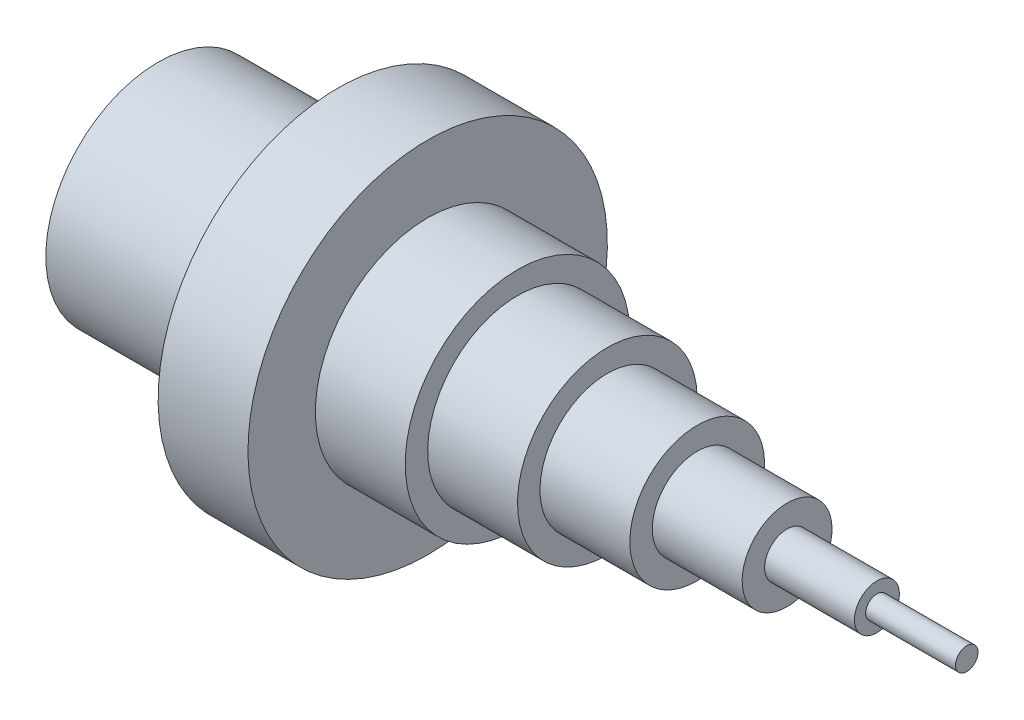
ISO-10303-21;
HEADER;
FILE_DESCRIPTION(('STEP AP214'),'2;1');
FILE_NAME('part.step','',(''),(''),'','','');
FILE_SCHEMA(('AUTOMOTIVE_DESIGN { 1 0 10303 214 1 1 1 1 }'));
ENDSEC;
DATA;
#1=APPLICATION_CONTEXT('core data for automotive mechanical design processes');
#2=APPLICATION_PROTOCOL_DEFINITION('international standard','automotive_design',2000,#1);
#3=PRODUCT_CONTEXT('',#1,'mechanical');
#4=PRODUCT('Part','Part','',(#3));
#5=PRODUCT_RELATED_PRODUCT_CATEGORY('part','',(#4));
#6=PRODUCT_DEFINITION_FORMATION('','',#4);
#7=PRODUCT_DEFINITION_CONTEXT('part definition',#1,'design');
#8=PRODUCT_DEFINITION('design','',#6,#7);
#9=PRODUCT_DEFINITION_SHAPE('','',#8);
#10=(LENGTH_UNIT() NAMED_UNIT(*) SI_UNIT(.MILLI.,.METRE.));
#11=(NAMED_UNIT(*) PLANE_ANGLE_UNIT() SI_UNIT($,.RADIAN.));
#12=(NAMED_UNIT(*) SI_UNIT($,.STERADIAN.) SOLID_ANGLE_UNIT());
#13=UNCERTAINTY_MEASURE_WITH_UNIT(LENGTH_MEASURE(1.E-05),#10,'distance_accuracy_value','');
#14=(GEOMETRIC_REPRESENTATION_CONTEXT(3) GLOBAL_UNCERTAINTY_ASSIGNED_CONTEXT((#13)) GLOBAL_UNIT_ASSIGNED_CONTEXT((#10,
#11,#12)) REPRESENTATION_CONTEXT('',''));
#15=CARTESIAN_POINT('',(0.,0.,0.));
#16=DIRECTION('',(0.,0.,1.));
#17=DIRECTION('',(1.,0.,0.));
#18=AXIS2_PLACEMENT_3D('',#15,#16,#17);
#19=CARTESIAN_POINT('',(139.774258593143,2.49999999999996,0.));
#20=DIRECTION('',(-1.,0.,0.));
#21=DIRECTION('',(0.,-1.,0.));
#22=AXIS2_PLACEMENT_3D('',#19,#20,#21);
#23=PLANE('',#22);
#24=CARTESIAN_POINT('',(139.774258593143,0.,0.));
#25=DIRECTION('',(-1.,0.,0.));
#26=DIRECTION('',(0.,-1.,0.));
#27=AXIS2_PLACEMENT_3D('',#24,#25,#26);
#28=CIRCLE('',#27,2.49999999999996);
#29=CARTESIAN_POINT('',(139.774258593143,-2.49999999999996,0.));
#30=VERTEX_POINT('',#29);
#31=EDGE_CURVE('E10',#30,#30,#28,.T.);
#32=ORIENTED_EDGE('',*,*,#31,.F.);
#33=EDGE_LOOP('',(#32));
#34=FACE_BOUND('',#33,.T.);
#35=ADVANCED_FACE('F31',(#34),#23,.F.);
#36=CARTESIAN_POINT('',(-74.7900935386828,0.,0.));
#37=DIRECTION('',(-1.,0.,0.));
#38=DIRECTION('',(0.,-1.,0.));
#39=AXIS2_PLACEMENT_3D('',#36,#37,#38);
#40=CYLINDRICAL_SURFACE('',#39,2.49999999999998);
#41=CARTESIAN_POINT('',(119.774258593143,0.,0.));
#42=DIRECTION('',(-1.,0.,0.));
#43=DIRECTION('',(0.,-1.,0.));
#44=AXIS2_PLACEMENT_3D('',#41,#42,#43);
#45=CIRCLE('',#44,2.5);
#46=CARTESIAN_POINT('',(119.774258593143,-2.5,0.));
#47=VERTEX_POINT('',#46);
#48=EDGE_CURVE('E37',#47,#47,#45,.T.);
#49=ORIENTED_EDGE('',*,*,#48,.F.);
#50=EDGE_LOOP('',(#49));
#51=FACE_BOUND('',#50,.T.);
#52=ORIENTED_EDGE('',*,*,#31,.T.);
#53=EDGE_LOOP('',(#52));
#54=FACE_BOUND('',#53,.T.);
#55=ADVANCED_FACE('F187',(#51,#54),#40,.T.);
#56=CARTESIAN_POINT('',(119.774258593143,5.,0.));
#57=DIRECTION('',(-1.,0.,0.));
#58=DIRECTION('',(0.,-1.,0.));
#59=AXIS2_PLACEMENT_3D('',#56,#57,#58);
#60=PLANE('',#59);
#61=CARTESIAN_POINT('',(119.774258593144,0.,0.));
#62=DIRECTION('',(-1.,0.,0.));
#63=DIRECTION('',(0.,-1.,0.));
#64=AXIS2_PLACEMENT_3D('',#61,#62,#63);
#65=CIRCLE('',#64,5.);
#66=CARTESIAN_POINT('',(119.774258593144,-5.,0.));
#67=VERTEX_POINT('',#66);
#68=EDGE_CURVE('E41',#67,#67,#65,.T.);
#69=ORIENTED_EDGE('',*,*,#68,.F.);
#70=EDGE_LOOP('',(#69));
#71=FACE_BOUND('',#70,.T.);
#72=ORIENTED_EDGE('',*,*,#48,.T.);
#73=EDGE_LOOP('',(#72));
#74=FACE_BOUND('',#73,.T.);
#75=ADVANCED_FACE('F182',(#71,#74),#60,.F.);
#76=CARTESIAN_POINT('',(-74.7900935386828,0.,0.));
#77=DIRECTION('',(-1.,0.,0.));
#78=DIRECTION('',(0.,-1.,0.));
#79=AXIS2_PLACEMENT_3D('',#76,#77,#78);
#80=CYLINDRICAL_SURFACE('',#79,5.);
#81=CARTESIAN_POINT('',(99.7742585931435,0.,0.));
#82=DIRECTION('',(-1.,0.,0.));
#83=DIRECTION('',(0.,-1.,0.));
#84=AXIS2_PLACEMENT_3D('',#81,#82,#83);
#85=CIRCLE('',#84,5.);
#86=CARTESIAN_POINT('',(99.7742585931435,-5.,0.));
#87=VERTEX_POINT('',#86);
#88=EDGE_CURVE('E45',#87,#87,#85,.T.);
#89=ORIENTED_EDGE('',*,*,#88,.F.);
#90=EDGE_LOOP('',(#89));
#91=FACE_BOUND('',#90,.T.);
#92=ORIENTED_EDGE('',*,*,#68,.T.);
#93=EDGE_LOOP('',(#92));
#94=FACE_BOUND('',#93,.T.);
#95=ADVANCED_FACE('F176',(#91,#94),#80,.T.);
#96=CARTESIAN_POINT('',(99.7742585931435,10.,0.));
#97=DIRECTION('',(-1.,0.,0.));
#98=DIRECTION('',(0.,-1.,0.));
#99=AXIS2_PLACEMENT_3D('',#96,#97,#98);
#100=PLANE('',#99);
#101=CARTESIAN_POINT('',(99.7742585931435,0.,0.));
#102=DIRECTION('',(-1.,0.,0.));
#103=DIRECTION('',(0.,-1.,0.));
#104=AXIS2_PLACEMENT_3D('',#101,#102,#103);
#105=CIRCLE('',#104,10.);
#106=CARTESIAN_POINT('',(99.7742585931435,-10.,0.));
#107=VERTEX_POINT('',#106);
#108=EDGE_CURVE('E50',#107,#107,#105,.T.);
#109=ORIENTED_EDGE('',*,*,#108,.F.);
#110=EDGE_LOOP('',(#109));
#111=FACE_BOUND('',#110,.T.);
#112=ORIENTED_EDGE('',*,*,#88,.T.);
#113=EDGE_LOOP('',(#112));
#114=FACE_BOUND('',#113,.T.);
#115=ADVANCED_FACE('F170',(#111,#114),#100,.F.);
#116=CARTESIAN_POINT('',(-74.7900935386828,0.,0.));
#117=DIRECTION('',(-1.,0.,0.));
#118=DIRECTION('',(0.,-1.,0.));
#119=AXIS2_PLACEMENT_3D('',#116,#117,#118);
#120=CYLINDRICAL_SURFACE('',#119,10.);
#121=CARTESIAN_POINT('',(79.7742585931435,0.,0.));
#122=DIRECTION('',(-1.,0.,0.));
#123=DIRECTION('',(0.,-1.,0.));
#124=AXIS2_PLACEMENT_3D('',#121,#122,#123);
#125=CIRCLE('',#124,10.);
#126=CARTESIAN_POINT('',(79.7742585931435,-10.,0.));
#127=VERTEX_POINT('',#126);
#128=EDGE_CURVE('E53',#127,#127,#125,.T.);
#129=ORIENTED_EDGE('',*,*,#128,.F.);
#130=EDGE_LOOP('',(#129));
#131=FACE_BOUND('',#130,.T.);
#132=ORIENTED_EDGE('',*,*,#108,.T.);
#133=EDGE_LOOP('',(#132));
#134=FACE_BOUND('',#133,.T.);
#135=ADVANCED_FACE('F164',(#131,#134),#120,.T.);
#136=CARTESIAN_POINT('',(79.7742585931435,15.,0.));
#137=DIRECTION('',(-1.,0.,0.));
#138=DIRECTION('',(0.,-1.,0.));
#139=AXIS2_PLACEMENT_3D('',#136,#137,#138);
#140=PLANE('',#139);
#141=CARTESIAN_POINT('',(79.7742585931435,0.,0.));
#142=DIRECTION('',(-1.,0.,0.));
#143=DIRECTION('',(0.,-1.,0.));
#144=AXIS2_PLACEMENT_3D('',#141,#142,#143);
#145=CIRCLE('',#144,15.);
#146=CARTESIAN_POINT('',(79.7742585931435,-15.,0.));
#147=VERTEX_POINT('',#146);
#148=EDGE_CURVE('E56',#147,#147,#145,.T.);
#149=ORIENTED_EDGE('',*,*,#148,.F.);
#150=EDGE_LOOP('',(#149));
#151=FACE_BOUND('',#150,.T.);
#152=ORIENTED_EDGE('',*,*,#128,.T.);
#153=EDGE_LOOP('',(#152));
#154=FACE_BOUND('',#153,.T.);
#155=ADVANCED_FACE('F158',(#151,#154),#140,.F.);
#156=CARTESIAN_POINT('',(-74.7900935386828,0.,0.));
#157=DIRECTION('',(-1.,0.,0.));
#158=DIRECTION('',(0.,-1.,0.));
#159=AXIS2_PLACEMENT_3D('',#156,#157,#158);
#160=CYLINDRICAL_SURFACE('',#159,15.);
#161=CARTESIAN_POINT('',(59.7742585931435,0.,0.));
#162=DIRECTION('',(-1.,0.,0.));
#163=DIRECTION('',(0.,-1.,0.));
#164=AXIS2_PLACEMENT_3D('',#161,#162,#163);
#165=CIRCLE('',#164,15.);
#166=CARTESIAN_POINT('',(59.7742585931435,-15.,0.));
#167=VERTEX_POINT('',#166);
#168=EDGE_CURVE('E59',#167,#167,#165,.T.);
#169=ORIENTED_EDGE('',*,*,#168,.F.);
#170=EDGE_LOOP('',(#169));
#171=FACE_BOUND('',#170,.T.);
#172=ORIENTED_EDGE('',*,*,#148,.T.);
#173=EDGE_LOOP('',(#172));
#174=FACE_BOUND('',#173,.T.);
#175=ADVANCED_FACE('F152',(#171,#174),#160,.T.);
#176=CARTESIAN_POINT('',(59.7742585931435,20.,0.));
#177=DIRECTION('',(-1.,0.,0.));
#178=DIRECTION('',(0.,-1.,0.));
#179=AXIS2_PLACEMENT_3D('',#176,#177,#178);
#180=PLANE('',#179);
#181=CARTESIAN_POINT('',(59.7742585931435,0.,0.));
#182=DIRECTION('',(-1.,0.,0.));
#183=DIRECTION('',(0.,-1.,0.));
#184=AXIS2_PLACEMENT_3D('',#181,#182,#183);
#185=CIRCLE('',#184,20.);
#186=CARTESIAN_POINT('',(59.7742585931435,-20.,0.));
#187=VERTEX_POINT('',#186);
#188=EDGE_CURVE('E62',#187,#187,#185,.T.);
#189=ORIENTED_EDGE('',*,*,#188,.F.);
#190=EDGE_LOOP('',(#189));
#191=FACE_BOUND('',#190,.T.);
#192=ORIENTED_EDGE('',*,*,#168,.T.);
#193=EDGE_LOOP('',(#192));
#194=FACE_BOUND('',#193,.T.);
#195=ADVANCED_FACE('F146',(#191,#194),#180,.F.);
#196=CARTESIAN_POINT('',(-74.7900935386828,0.,0.));
#197=DIRECTION('',(-1.,0.,0.));
#198=DIRECTION('',(0.,-1.,0.));
#199=AXIS2_PLACEMENT_3D('',#196,#197,#198);
#200=CYLINDRICAL_SURFACE('',#199,20.);
#201=CARTESIAN_POINT('',(39.7742585931435,0.,0.));
#202=DIRECTION('',(-1.,0.,0.));
#203=DIRECTION('',(0.,-1.,0.));
#204=AXIS2_PLACEMENT_3D('',#201,#202,#203);
#205=CIRCLE('',#204,20.);
#206=CARTESIAN_POINT('',(39.7742585931435,-20.,0.));
#207=VERTEX_POINT('',#206);
#208=EDGE_CURVE('E65',#207,#207,#205,.T.);
#209=ORIENTED_EDGE('',*,*,#208,.F.);
#210=EDGE_LOOP('',(#209));
#211=FACE_BOUND('',#210,.T.);
#212=ORIENTED_EDGE('',*,*,#188,.T.);
#213=EDGE_LOOP('',(#212));
#214=FACE_BOUND('',#213,.T.);
#215=ADVANCED_FACE('F140',(#211,#214),#200,.T.);
#216=CARTESIAN_POINT('',(39.7742585931435,25.,0.));
#217=DIRECTION('',(-1.,0.,0.));
#218=DIRECTION('',(0.,-1.,0.));
#219=AXIS2_PLACEMENT_3D('',#216,#217,#218);
#220=PLANE('',#219);
#221=CARTESIAN_POINT('',(39.7742585931435,0.,0.));
#222=DIRECTION('',(-1.,0.,0.));
#223=DIRECTION('',(0.,-1.,0.));
#224=AXIS2_PLACEMENT_3D('',#221,#222,#223);
#225=CIRCLE('',#224,25.);
#226=CARTESIAN_POINT('',(39.7742585931435,-25.,0.));
#227=VERTEX_POINT('',#226);
#228=EDGE_CURVE('E68',#227,#227,#225,.T.);
#229=ORIENTED_EDGE('',*,*,#228,.F.);
#230=EDGE_LOOP('',(#229));
#231=FACE_BOUND('',#230,.T.);
#232=ORIENTED_EDGE('',*,*,#208,.T.);
#233=EDGE_LOOP('',(#232));
#234=FACE_BOUND('',#233,.T.);
#235=ADVANCED_FACE('F134',(#231,#234),#220,.F.);
#236=CARTESIAN_POINT('',(-74.7900935386828,0.,0.));
#237=DIRECTION('',(-1.,0.,0.));
#238=DIRECTION('',(0.,-1.,0.));
#239=AXIS2_PLACEMENT_3D('',#236,#237,#238);
#240=CYLINDRICAL_SURFACE('',#239,25.);
#241=CARTESIAN_POINT('',(19.7742585931435,0.,0.));
#242=DIRECTION('',(-1.,0.,0.));
#243=DIRECTION('',(0.,-1.,0.));
#244=AXIS2_PLACEMENT_3D('',#241,#242,#243);
#245=CIRCLE('',#244,25.);
#246=CARTESIAN_POINT('',(19.7742585931435,-25.,0.));
#247=VERTEX_POINT('',#246);
#248=EDGE_CURVE('E71',#247,#247,#245,.T.);
#249=ORIENTED_EDGE('',*,*,#248,.F.);
#250=EDGE_LOOP('',(#249));
#251=FACE_BOUND('',#250,.T.);
#252=ORIENTED_EDGE('',*,*,#228,.T.);
#253=EDGE_LOOP('',(#252));
#254=FACE_BOUND('',#253,.T.);
#255=ADVANCED_FACE('F128',(#251,#254),#240,.T.);
#256=CARTESIAN_POINT('',(19.7742585931435,40.,0.));
#257=DIRECTION('',(-1.,0.,0.));
#258=DIRECTION('',(0.,-1.,0.));
#259=AXIS2_PLACEMENT_3D('',#256,#257,#258);
#260=PLANE('',#259);
#261=CARTESIAN_POINT('',(19.7742585931435,0.,0.));
#262=DIRECTION('',(-1.,0.,0.));
#263=DIRECTION('',(0.,-1.,0.));
#264=AXIS2_PLACEMENT_3D('',#261,#262,#263);
#265=CIRCLE('',#264,40.);
#266=CARTESIAN_POINT('',(19.7742585931435,-40.,0.));
#267=VERTEX_POINT('',#266);
#268=EDGE_CURVE('E74',#267,#267,#265,.T.);
#269=ORIENTED_EDGE('',*,*,#268,.F.);
#270=EDGE_LOOP('',(#269));
#271=FACE_BOUND('',#270,.T.);
#272=ORIENTED_EDGE('',*,*,#248,.T.);
#273=EDGE_LOOP('',(#272));
#274=FACE_BOUND('',#273,.T.);
#275=ADVANCED_FACE('F122',(#271,#274),#260,.F.);
#276=CARTESIAN_POINT('',(-74.7900935386828,0.,0.));
#277=DIRECTION('',(-1.,0.,0.));
#278=DIRECTION('',(0.,-1.,0.));
#279=AXIS2_PLACEMENT_3D('',#276,#277,#278);
#280=CYLINDRICAL_SURFACE('',#279,40.);
#281=CARTESIAN_POINT('',(-0.225741406856508,0.,0.));
#282=DIRECTION('',(-1.,0.,0.));
#283=DIRECTION('',(0.,-1.,0.));
#284=AXIS2_PLACEMENT_3D('',#281,#282,#283);
#285=CIRCLE('',#284,40.);
#286=CARTESIAN_POINT('',(-0.225741406856508,-40.,0.));
#287=VERTEX_POINT('',#286);
#288=EDGE_CURVE('E77',#287,#287,#285,.T.);
#289=ORIENTED_EDGE('',*,*,#288,.F.);
#290=EDGE_LOOP('',(#289));
#291=FACE_BOUND('',#290,.T.);
#292=ORIENTED_EDGE('',*,*,#268,.T.);
#293=EDGE_LOOP('',(#292));
#294=FACE_BOUND('',#293,.T.);
#295=ADVANCED_FACE('F116',(#291,#294),#280,.T.);
#296=CARTESIAN_POINT('',(-0.225741406856503,25.,0.));
#297=DIRECTION('',(1.,0.,0.));
#298=DIRECTION('',(0.,1.,0.));
#299=AXIS2_PLACEMENT_3D('',#296,#297,#298);
#300=PLANE('',#299);
#301=CARTESIAN_POINT('',(-0.225741406856508,0.,0.));
#302=DIRECTION('',(-1.,0.,0.));
#303=DIRECTION('',(0.,-1.,0.));
#304=AXIS2_PLACEMENT_3D('',#301,#302,#303);
#305=CIRCLE('',#304,25.);
#306=CARTESIAN_POINT('',(-0.225741406856508,-25.,0.));
#307=VERTEX_POINT('',#306);
#308=EDGE_CURVE('E80',#307,#307,#305,.T.);
#309=ORIENTED_EDGE('',*,*,#308,.F.);
#310=EDGE_LOOP('',(#309));
#311=FACE_BOUND('',#310,.T.);
#312=ORIENTED_EDGE('',*,*,#288,.T.);
#313=EDGE_LOOP('',(#312));
#314=FACE_BOUND('',#313,.T.);
#315=ADVANCED_FACE('F110',(#311,#314),#300,.F.);
#316=CARTESIAN_POINT('',(-74.7900935386828,0.,0.));
#317=DIRECTION('',(-1.,0.,0.));
#318=DIRECTION('',(0.,-1.,0.));
#319=AXIS2_PLACEMENT_3D('',#316,#317,#318);
#320=CYLINDRICAL_SURFACE('',#319,25.);
#321=CARTESIAN_POINT('',(-40.2257414068565,0.,0.));
#322=DIRECTION('',(-1.,0.,0.));
#323=DIRECTION('',(0.,-1.,0.));
#324=AXIS2_PLACEMENT_3D('',#321,#322,#323);
#325=CIRCLE('',#324,25.);
#326=CARTESIAN_POINT('',(-40.2257414068565,-25.,0.));
#327=VERTEX_POINT('',#326);
#328=EDGE_CURVE('E83',#327,#327,#325,.T.);
#329=ORIENTED_EDGE('',*,*,#328,.F.);
#330=EDGE_LOOP('',(#329));
#331=FACE_BOUND('',#330,.T.);
#332=ORIENTED_EDGE('',*,*,#308,.T.);
#333=EDGE_LOOP('',(#332));
#334=FACE_BOUND('',#333,.T.);
#335=ADVANCED_FACE('F104',(#331,#334),#320,.T.);
#336=CARTESIAN_POINT('',(-40.2257414068565,20.,0.));
#337=DIRECTION('',(1.,0.,0.));
#338=DIRECTION('',(0.,1.,0.));
#339=AXIS2_PLACEMENT_3D('',#336,#337,#338);
#340=PLANE('',#339);
#341=CARTESIAN_POINT('',(-40.2257414068565,0.,0.));
#342=DIRECTION('',(-1.,0.,0.));
#343=DIRECTION('',(0.,-1.,0.));
#344=AXIS2_PLACEMENT_3D('',#341,#342,#343);
#345=CIRCLE('',#344,20.);
#346=CARTESIAN_POINT('',(-40.2257414068565,-20.,0.));
#347=VERTEX_POINT('',#346);
#348=EDGE_CURVE('E86',#347,#347,#345,.T.);
#349=ORIENTED_EDGE('',*,*,#348,.F.);
#350=EDGE_LOOP('',(#349));
#351=FACE_BOUND('',#350,.T.);
#352=ORIENTED_EDGE('',*,*,#328,.T.);
#353=EDGE_LOOP('',(#352));
#354=FACE_BOUND('',#353,.T.);
#355=ADVANCED_FACE('F98',(#351,#354),#340,.F.);
#356=CARTESIAN_POINT('',(-74.7900935386828,0.,0.));
#357=DIRECTION('',(-1.,0.,0.));
#358=DIRECTION('',(0.,-1.,0.));
#359=AXIS2_PLACEMENT_3D('',#356,#357,#358);
#360=CYLINDRICAL_SURFACE('',#359,20.);
#361=CARTESIAN_POINT('',(-0.122966014876158,0.,0.));
#362=DIRECTION('',(-1.,0.,0.));
#363=DIRECTION('',(0.,-1.,0.));
#364=AXIS2_PLACEMENT_3D('',#361,#362,#363);
#365=CIRCLE('',#364,20.);
#366=CARTESIAN_POINT('',(-0.122966014876158,-20.,0.));
#367=VERTEX_POINT('',#366);
#368=EDGE_CURVE('E89',#367,#367,#365,.T.);
#369=ORIENTED_EDGE('',*,*,#368,.F.);
#370=EDGE_LOOP('',(#369));
#371=FACE_BOUND('',#370,.T.);
#372=ORIENTED_EDGE('',*,*,#348,.T.);
#373=EDGE_LOOP('',(#372));
#374=FACE_BOUND('',#373,.T.);
#375=ADVANCED_FACE('F95',(#371,#374),#360,.F.);
#376=CARTESIAN_POINT('',(-0.122966014876159,20.,0.));
#377=DIRECTION('',(1.,0.,0.));
#378=DIRECTION('',(0.,1.,0.));
#379=AXIS2_PLACEMENT_3D('',#376,#377,#378);
#380=PLANE('',#379);
#381=ORIENTED_EDGE('',*,*,#368,.T.);
#382=EDGE_LOOP('',(#381));
#383=FACE_BOUND('',#382,.T.);
#384=ADVANCED_FACE('F93',(#383),#380,.F.);
#385=CLOSED_SHELL('',(#35,#55,#75,#95,#115,#135,#155,#175,#195,#215,#235,#255,#275,#295,#315,
#335,#355,#375,#384));
#386=MANIFOLD_SOLID_BREP('B2',#385);
#387=ADVANCED_BREP_SHAPE_REPRESENTATION('',(#18,#386),#14);
#388=SHAPE_DEFINITION_REPRESENTATION(#9,#387);
ENDSEC;
END-ISO-10303-21;
